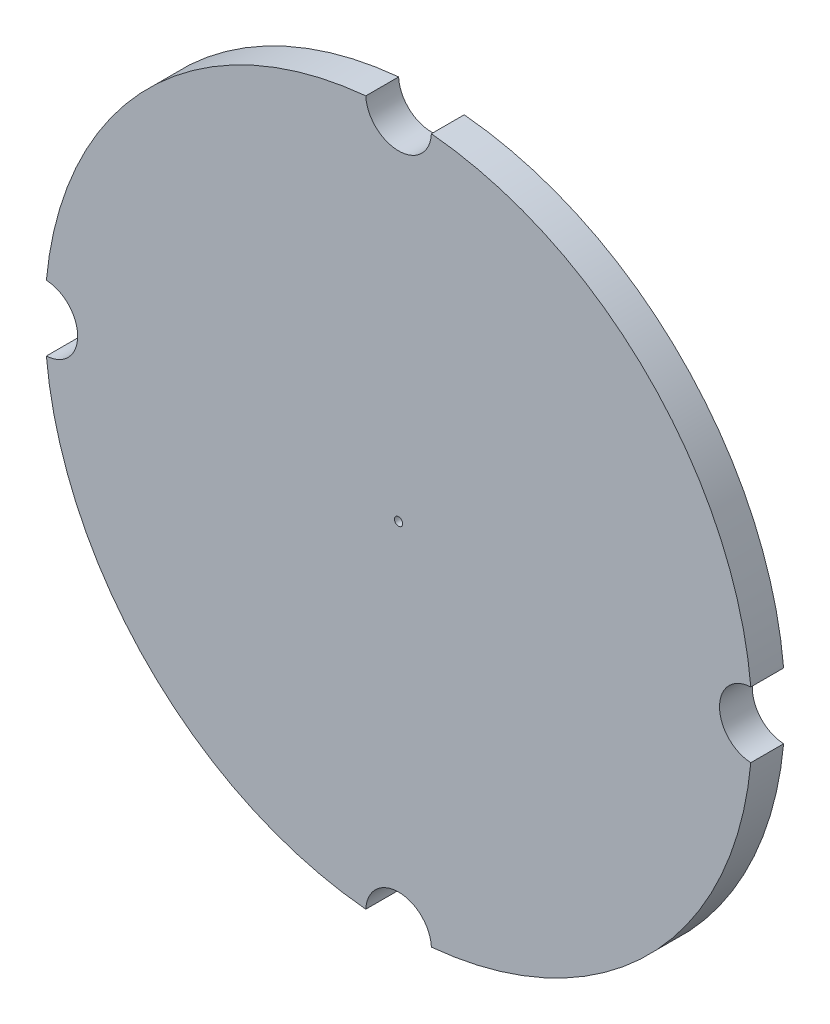
ISO-10303-21;
HEADER;
FILE_DESCRIPTION(('STEP AP214'),'2;1');
FILE_NAME('part.step','',(''),(''),'','','');
FILE_SCHEMA(('AUTOMOTIVE_DESIGN { 1 0 10303 214 1 1 1 1 }'));
ENDSEC;
DATA;
#1=APPLICATION_CONTEXT('core data for automotive mechanical design processes');
#2=APPLICATION_PROTOCOL_DEFINITION('international standard','automotive_design',2000,#1);
#3=PRODUCT_CONTEXT('',#1,'mechanical');
#4=PRODUCT('Part','Part','',(#3));
#5=PRODUCT_RELATED_PRODUCT_CATEGORY('part','',(#4));
#6=PRODUCT_DEFINITION_FORMATION('','',#4);
#7=PRODUCT_DEFINITION_CONTEXT('part definition',#1,'design');
#8=PRODUCT_DEFINITION('design','',#6,#7);
#9=PRODUCT_DEFINITION_SHAPE('','',#8);
#10=(LENGTH_UNIT() NAMED_UNIT(*) SI_UNIT(.MILLI.,.METRE.));
#11=(NAMED_UNIT(*) PLANE_ANGLE_UNIT() SI_UNIT($,.RADIAN.));
#12=(NAMED_UNIT(*) SI_UNIT($,.STERADIAN.) SOLID_ANGLE_UNIT());
#13=UNCERTAINTY_MEASURE_WITH_UNIT(LENGTH_MEASURE(1.E-05),#10,'distance_accuracy_value','');
#14=(GEOMETRIC_REPRESENTATION_CONTEXT(3) GLOBAL_UNCERTAINTY_ASSIGNED_CONTEXT((#13)) GLOBAL_UNIT_ASSIGNED_CONTEXT((#10,
#11,#12)) REPRESENTATION_CONTEXT('',''));
#15=CARTESIAN_POINT('',(0.,0.,0.));
#16=DIRECTION('',(0.,0.,1.));
#17=DIRECTION('',(1.,0.,0.));
#18=AXIS2_PLACEMENT_3D('',#15,#16,#17);
#19=CARTESIAN_POINT('',(0.,215.52614690566,20.));
#20=DIRECTION('',(0.,0.,-1.));
#21=DIRECTION('',(-1.,0.,0.));
#22=AXIS2_PLACEMENT_3D('',#19,#20,#21);
#23=CYLINDRICAL_SURFACE('',#22,20.);
#24=CARTESIAN_POINT('',(0.,215.52614690566,0.));
#25=DIRECTION('',(0.,0.,1.));
#26=DIRECTION('',(1.,0.,0.));
#27=AXIS2_PLACEMENT_3D('',#24,#25,#26);
#28=CIRCLE('',#27,20.);
#29=CARTESIAN_POINT('',(-19.9784605805017,214.598185250559,0.));
#30=VERTEX_POINT('',#29);
#31=CARTESIAN_POINT('',(19.9784605805017,214.598185250559,0.));
#32=VERTEX_POINT('',#31);
#33=EDGE_CURVE('E139',#30,#32,#28,.T.);
#34=ORIENTED_EDGE('',*,*,#33,.F.);
#35=DIRECTION('',(0.,0.,-1.));
#36=VECTOR('',#35,1.);
#37=CARTESIAN_POINT('',(-19.9784605805017,214.598185250559,20.));
#38=LINE('',#37,#36);
#39=CARTESIAN_POINT('',(-19.9784605805017,214.598185250559,20.));
#40=VERTEX_POINT('',#39);
#41=EDGE_CURVE('E11',#40,#30,#38,.T.);
#42=ORIENTED_EDGE('',*,*,#41,.F.);
#43=CARTESIAN_POINT('',(0.,215.52614690566,20.));
#44=DIRECTION('',(0.,0.,1.));
#45=DIRECTION('',(1.,0.,0.));
#46=AXIS2_PLACEMENT_3D('',#43,#44,#45);
#47=CIRCLE('',#46,20.);
#48=CARTESIAN_POINT('',(19.9784605805017,214.598185250559,20.));
#49=VERTEX_POINT('',#48);
#50=EDGE_CURVE('E180',#40,#49,#47,.T.);
#51=ORIENTED_EDGE('',*,*,#50,.T.);
#52=DIRECTION('',(0.,0.,-1.));
#53=VECTOR('',#52,1.);
#54=CARTESIAN_POINT('',(19.9784605805017,214.598185250559,20.));
#55=LINE('',#54,#53);
#56=EDGE_CURVE('E91',#49,#32,#55,.T.);
#57=ORIENTED_EDGE('',*,*,#56,.T.);
#58=EDGE_LOOP('',(#34,#42,#51,#57));
#59=FACE_BOUND('',#58,.T.);
#60=ADVANCED_FACE('F40',(#59),#23,.F.);
#61=CARTESIAN_POINT('',(0.,0.,20.));
#62=DIRECTION('',(0.,0.,-1.));
#63=DIRECTION('',(-1.,0.,0.));
#64=AXIS2_PLACEMENT_3D('',#61,#62,#63);
#65=CYLINDRICAL_SURFACE('',#64,215.52614690566);
#66=CARTESIAN_POINT('',(0.,0.,0.));
#67=DIRECTION('',(0.,0.,1.));
#68=DIRECTION('',(1.,0.,0.));
#69=AXIS2_PLACEMENT_3D('',#66,#67,#68);
#70=CIRCLE('',#69,215.52614690566);
#71=CARTESIAN_POINT('',(-214.598185250559,19.9784605805017,0.));
#72=VERTEX_POINT('',#71);
#73=EDGE_CURVE('E142',#30,#72,#70,.T.);
#74=ORIENTED_EDGE('',*,*,#73,.T.);
#75=DIRECTION('',(0.,0.,-1.));
#76=VECTOR('',#75,1.);
#77=CARTESIAN_POINT('',(-214.598185250559,19.9784605805017,20.));
#78=LINE('',#77,#76);
#79=CARTESIAN_POINT('',(-214.598185250559,19.9784605805017,20.));
#80=VERTEX_POINT('',#79);
#81=EDGE_CURVE('E49',#80,#72,#78,.T.);
#82=ORIENTED_EDGE('',*,*,#81,.F.);
#83=CARTESIAN_POINT('',(0.,0.,20.));
#84=DIRECTION('',(0.,0.,1.));
#85=DIRECTION('',(1.,0.,0.));
#86=AXIS2_PLACEMENT_3D('',#83,#84,#85);
#87=CIRCLE('',#86,215.52614690566);
#88=EDGE_CURVE('E132',#40,#80,#87,.T.);
#89=ORIENTED_EDGE('',*,*,#88,.F.);
#90=ORIENTED_EDGE('',*,*,#41,.T.);
#91=EDGE_LOOP('',(#74,#82,#89,#90));
#92=FACE_BOUND('',#91,.T.);
#93=ADVANCED_FACE('F170',(#92),#65,.T.);
#94=CARTESIAN_POINT('',(-215.52614690566,0.,20.));
#95=DIRECTION('',(0.,0.,-1.));
#96=DIRECTION('',(-1.,0.,0.));
#97=AXIS2_PLACEMENT_3D('',#94,#95,#96);
#98=CYLINDRICAL_SURFACE('',#97,20.);
#99=CARTESIAN_POINT('',(-215.52614690566,0.,0.));
#100=DIRECTION('',(0.,0.,1.));
#101=DIRECTION('',(1.,0.,0.));
#102=AXIS2_PLACEMENT_3D('',#99,#100,#101);
#103=CIRCLE('',#102,20.);
#104=CARTESIAN_POINT('',(-214.598185250559,-19.9784605805017,0.));
#105=VERTEX_POINT('',#104);
#106=EDGE_CURVE('E145',#105,#72,#103,.T.);
#107=ORIENTED_EDGE('',*,*,#106,.F.);
#108=DIRECTION('',(0.,0.,-1.));
#109=VECTOR('',#108,1.);
#110=CARTESIAN_POINT('',(-214.598185250559,-19.9784605805017,20.));
#111=LINE('',#110,#109);
#112=CARTESIAN_POINT('',(-214.598185250559,-19.9784605805017,20.));
#113=VERTEX_POINT('',#112);
#114=EDGE_CURVE('E160',#113,#105,#111,.T.);
#115=ORIENTED_EDGE('',*,*,#114,.F.);
#116=CARTESIAN_POINT('',(-215.52614690566,0.,20.));
#117=DIRECTION('',(0.,0.,1.));
#118=DIRECTION('',(1.,0.,0.));
#119=AXIS2_PLACEMENT_3D('',#116,#117,#118);
#120=CIRCLE('',#119,20.);
#121=EDGE_CURVE('E167',#113,#80,#120,.T.);
#122=ORIENTED_EDGE('',*,*,#121,.T.);
#123=ORIENTED_EDGE('',*,*,#81,.T.);
#124=EDGE_LOOP('',(#107,#115,#122,#123));
#125=FACE_BOUND('',#124,.T.);
#126=ADVANCED_FACE('F165',(#125),#98,.F.);
#127=CARTESIAN_POINT('',(-19.9784605805017,-214.598185250559,0.));
#128=VERTEX_POINT('',#127);
#129=EDGE_CURVE('E147',#105,#128,#70,.T.);
#130=ORIENTED_EDGE('',*,*,#129,.T.);
#131=DIRECTION('',(0.,0.,-1.));
#132=VECTOR('',#131,1.);
#133=CARTESIAN_POINT('',(-19.9784605805017,-214.598185250559,20.));
#134=LINE('',#133,#132);
#135=CARTESIAN_POINT('',(-19.9784605805017,-214.598185250559,20.));
#136=VERTEX_POINT('',#135);
#137=EDGE_CURVE('E158',#136,#128,#134,.T.);
#138=ORIENTED_EDGE('',*,*,#137,.F.);
#139=EDGE_CURVE('E119',#113,#136,#87,.T.);
#140=ORIENTED_EDGE('',*,*,#139,.F.);
#141=ORIENTED_EDGE('',*,*,#114,.T.);
#142=EDGE_LOOP('',(#130,#138,#140,#141));
#143=FACE_BOUND('',#142,.T.);
#144=ADVANCED_FACE('F193',(#143),#65,.T.);
#145=CARTESIAN_POINT('',(0.,-215.52614690566,20.));
#146=DIRECTION('',(0.,0.,-1.));
#147=DIRECTION('',(-1.,0.,0.));
#148=AXIS2_PLACEMENT_3D('',#145,#146,#147);
#149=CYLINDRICAL_SURFACE('',#148,20.);
#150=CARTESIAN_POINT('',(0.,-215.52614690566,0.));
#151=DIRECTION('',(0.,0.,1.));
#152=DIRECTION('',(1.,0.,0.));
#153=AXIS2_PLACEMENT_3D('',#150,#151,#152);
#154=CIRCLE('',#153,20.);
#155=CARTESIAN_POINT('',(19.9784605805017,-214.598185250559,0.));
#156=VERTEX_POINT('',#155);
#157=EDGE_CURVE('E150',#156,#128,#154,.T.);
#158=ORIENTED_EDGE('',*,*,#157,.F.);
#159=DIRECTION('',(0.,0.,-1.));
#160=VECTOR('',#159,1.);
#161=CARTESIAN_POINT('',(19.9784605805017,-214.598185250559,20.));
#162=LINE('',#161,#160);
#163=CARTESIAN_POINT('',(19.9784605805017,-214.598185250559,20.));
#164=VERTEX_POINT('',#163);
#165=EDGE_CURVE('E128',#164,#156,#162,.T.);
#166=ORIENTED_EDGE('',*,*,#165,.F.);
#167=CARTESIAN_POINT('',(0.,-215.52614690566,20.));
#168=DIRECTION('',(0.,0.,1.));
#169=DIRECTION('',(1.,0.,0.));
#170=AXIS2_PLACEMENT_3D('',#167,#168,#169);
#171=CIRCLE('',#170,20.);
#172=EDGE_CURVE('E116',#164,#136,#171,.T.);
#173=ORIENTED_EDGE('',*,*,#172,.T.);
#174=ORIENTED_EDGE('',*,*,#137,.T.);
#175=EDGE_LOOP('',(#158,#166,#173,#174));
#176=FACE_BOUND('',#175,.T.);
#177=ADVANCED_FACE('F187',(#176),#149,.F.);
#178=CARTESIAN_POINT('',(214.598185250559,-19.9784605805017,0.));
#179=VERTEX_POINT('',#178);
#180=EDGE_CURVE('E124',#156,#179,#70,.T.);
#181=ORIENTED_EDGE('',*,*,#180,.T.);
#182=DIRECTION('',(0.,0.,-1.));
#183=VECTOR('',#182,1.);
#184=CARTESIAN_POINT('',(214.598185250559,-19.9784605805017,20.));
#185=LINE('',#184,#183);
#186=CARTESIAN_POINT('',(214.598185250559,-19.9784605805017,20.));
#187=VERTEX_POINT('',#186);
#188=EDGE_CURVE('E121',#187,#179,#185,.T.);
#189=ORIENTED_EDGE('',*,*,#188,.F.);
#190=EDGE_CURVE('E110',#164,#187,#87,.T.);
#191=ORIENTED_EDGE('',*,*,#190,.F.);
#192=ORIENTED_EDGE('',*,*,#165,.T.);
#193=EDGE_LOOP('',(#181,#189,#191,#192));
#194=FACE_BOUND('',#193,.T.);
#195=ADVANCED_FACE('F122',(#194),#65,.T.);
#196=CARTESIAN_POINT('',(215.52614690566,0.,20.));
#197=DIRECTION('',(0.,0.,-1.));
#198=DIRECTION('',(-1.,0.,0.));
#199=AXIS2_PLACEMENT_3D('',#196,#197,#198);
#200=CYLINDRICAL_SURFACE('',#199,20.);
#201=CARTESIAN_POINT('',(215.52614690566,0.,0.));
#202=DIRECTION('',(0.,0.,1.));
#203=DIRECTION('',(1.,0.,0.));
#204=AXIS2_PLACEMENT_3D('',#201,#202,#203);
#205=CIRCLE('',#204,20.);
#206=CARTESIAN_POINT('',(214.598185250559,19.9784605805017,0.));
#207=VERTEX_POINT('',#206);
#208=EDGE_CURVE('E153',#207,#179,#205,.T.);
#209=ORIENTED_EDGE('',*,*,#208,.F.);
#210=DIRECTION('',(0.,0.,-1.));
#211=VECTOR('',#210,1.);
#212=CARTESIAN_POINT('',(214.598185250559,19.9784605805017,20.));
#213=LINE('',#212,#211);
#214=CARTESIAN_POINT('',(214.598185250559,19.9784605805017,20.));
#215=VERTEX_POINT('',#214);
#216=EDGE_CURVE('E84',#215,#207,#213,.T.);
#217=ORIENTED_EDGE('',*,*,#216,.F.);
#218=CARTESIAN_POINT('',(215.52614690566,0.,20.));
#219=DIRECTION('',(0.,0.,1.));
#220=DIRECTION('',(1.,0.,0.));
#221=AXIS2_PLACEMENT_3D('',#218,#219,#220);
#222=CIRCLE('',#221,20.);
#223=EDGE_CURVE('E114',#215,#187,#222,.T.);
#224=ORIENTED_EDGE('',*,*,#223,.T.);
#225=ORIENTED_EDGE('',*,*,#188,.T.);
#226=EDGE_LOOP('',(#209,#217,#224,#225));
#227=FACE_BOUND('',#226,.T.);
#228=ADVANCED_FACE('F130',(#227),#200,.F.);
#229=CARTESIAN_POINT('',(0.,0.,20.));
#230=DIRECTION('',(0.,0.,-1.));
#231=DIRECTION('',(-1.,0.,0.));
#232=AXIS2_PLACEMENT_3D('',#229,#230,#231);
#233=CYLINDRICAL_SURFACE('',#232,2.5);
#234=CARTESIAN_POINT('',(0.,0.,20.));
#235=DIRECTION('',(0.,0.,1.));
#236=DIRECTION('',(1.,0.,0.));
#237=AXIS2_PLACEMENT_3D('',#234,#235,#236);
#238=CIRCLE('',#237,2.5);
#239=CARTESIAN_POINT('',(2.5,0.,20.));
#240=VERTEX_POINT('',#239);
#241=EDGE_CURVE('E178',#240,#240,#238,.T.);
#242=ORIENTED_EDGE('',*,*,#241,.T.);
#243=EDGE_LOOP('',(#242));
#244=FACE_BOUND('',#243,.T.);
#245=CARTESIAN_POINT('',(0.,0.,0.));
#246=DIRECTION('',(0.,0.,1.));
#247=DIRECTION('',(1.,0.,0.));
#248=AXIS2_PLACEMENT_3D('',#245,#246,#247);
#249=CIRCLE('',#248,2.5);
#250=CARTESIAN_POINT('',(2.5,0.,0.));
#251=VERTEX_POINT('',#250);
#252=EDGE_CURVE('E136',#251,#251,#249,.T.);
#253=ORIENTED_EDGE('',*,*,#252,.F.);
#254=EDGE_LOOP('',(#253));
#255=FACE_BOUND('',#254,.T.);
#256=ADVANCED_FACE('F42',(#244,#255),#233,.F.);
#257=EDGE_CURVE('E146',#207,#32,#70,.T.);
#258=ORIENTED_EDGE('',*,*,#257,.T.);
#259=ORIENTED_EDGE('',*,*,#56,.F.);
#260=EDGE_CURVE('E57',#215,#49,#87,.T.);
#261=ORIENTED_EDGE('',*,*,#260,.F.);
#262=ORIENTED_EDGE('',*,*,#216,.T.);
#263=EDGE_LOOP('',(#258,#259,#261,#262));
#264=FACE_BOUND('',#263,.T.);
#265=ADVANCED_FACE('F194',(#264),#65,.T.);
#266=CARTESIAN_POINT('',(0.,0.,20.));
#267=DIRECTION('',(0.,0.,1.));
#268=DIRECTION('',(1.,0.,0.));
#269=AXIS2_PLACEMENT_3D('',#266,#267,#268);
#270=PLANE('',#269);
#271=ORIENTED_EDGE('',*,*,#241,.F.);
#272=EDGE_LOOP('',(#271));
#273=FACE_BOUND('',#272,.T.);
#274=ORIENTED_EDGE('',*,*,#50,.F.);
#275=ORIENTED_EDGE('',*,*,#88,.T.);
#276=ORIENTED_EDGE('',*,*,#121,.F.);
#277=ORIENTED_EDGE('',*,*,#139,.T.);
#278=ORIENTED_EDGE('',*,*,#172,.F.);
#279=ORIENTED_EDGE('',*,*,#190,.T.);
#280=ORIENTED_EDGE('',*,*,#223,.F.);
#281=ORIENTED_EDGE('',*,*,#260,.T.);
#282=EDGE_LOOP('',(#274,#275,#276,#277,#278,#279,#280,#281));
#283=FACE_BOUND('',#282,.T.);
#284=ADVANCED_FACE('F112',(#273,#283),#270,.T.);
#285=CARTESIAN_POINT('',(0.,0.,0.));
#286=DIRECTION('',(0.,0.,1.));
#287=DIRECTION('',(1.,0.,0.));
#288=AXIS2_PLACEMENT_3D('',#285,#286,#287);
#289=PLANE('',#288);
#290=ORIENTED_EDGE('',*,*,#252,.T.);
#291=EDGE_LOOP('',(#290));
#292=FACE_BOUND('',#291,.T.);
#293=ORIENTED_EDGE('',*,*,#33,.T.);
#294=ORIENTED_EDGE('',*,*,#257,.F.);
#295=ORIENTED_EDGE('',*,*,#208,.T.);
#296=ORIENTED_EDGE('',*,*,#180,.F.);
#297=ORIENTED_EDGE('',*,*,#157,.T.);
#298=ORIENTED_EDGE('',*,*,#129,.F.);
#299=ORIENTED_EDGE('',*,*,#106,.T.);
#300=ORIENTED_EDGE('',*,*,#73,.F.);
#301=EDGE_LOOP('',(#293,#294,#295,#296,#297,#298,#299,#300));
#302=FACE_BOUND('',#301,.T.);
#303=ADVANCED_FACE('F173',(#292,#302),#289,.F.);
#304=CLOSED_SHELL('',(#60,#93,#126,#144,#177,#195,#228,#256,#265,#284,#303));
#305=MANIFOLD_SOLID_BREP('B2',#304);
#306=ADVANCED_BREP_SHAPE_REPRESENTATION('',(#18,#305),#14);
#307=SHAPE_DEFINITION_REPRESENTATION(#9,#306);
ENDSEC;
END-ISO-10303-21;
